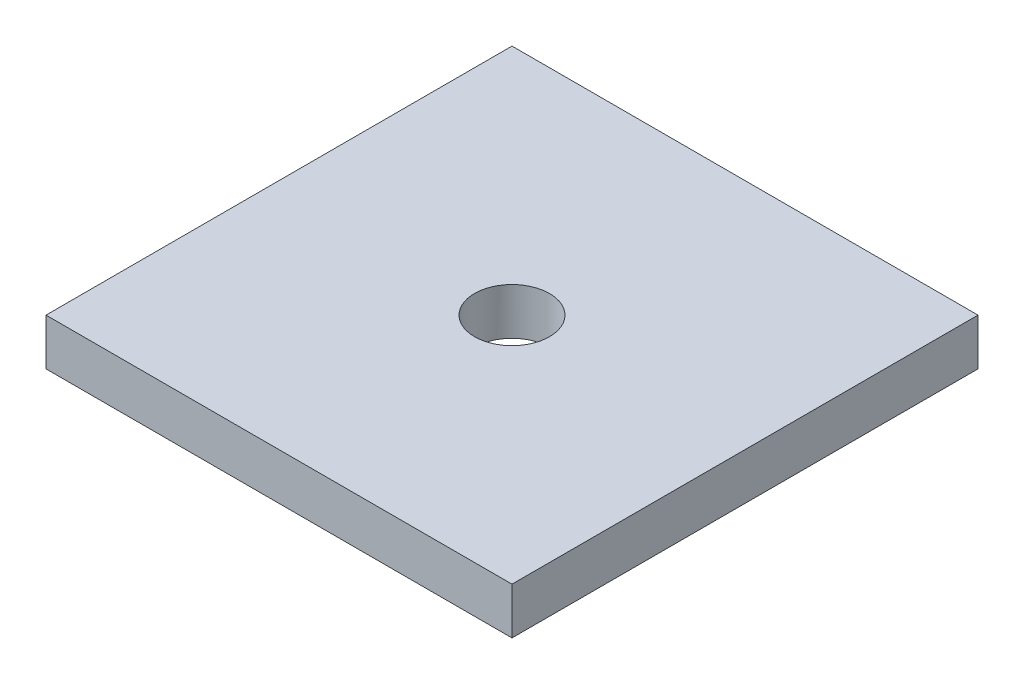
ISO-10303-21;
HEADER;
FILE_DESCRIPTION(('STEP AP214'),'2;1');
FILE_NAME('part.step','',(''),(''),'','','');
FILE_SCHEMA(('AUTOMOTIVE_DESIGN { 1 0 10303 214 1 1 1 1 }'));
ENDSEC;
DATA;
#1=APPLICATION_CONTEXT('core data for automotive mechanical design processes');
#2=APPLICATION_PROTOCOL_DEFINITION('international standard','automotive_design',2000,#1);
#3=PRODUCT_CONTEXT('',#1,'mechanical');
#4=PRODUCT('Part','Part','',(#3));
#5=PRODUCT_RELATED_PRODUCT_CATEGORY('part','',(#4));
#6=PRODUCT_DEFINITION_FORMATION('','',#4);
#7=PRODUCT_DEFINITION_CONTEXT('part definition',#1,'design');
#8=PRODUCT_DEFINITION('design','',#6,#7);
#9=PRODUCT_DEFINITION_SHAPE('','',#8);
#10=(LENGTH_UNIT() NAMED_UNIT(*) SI_UNIT(.MILLI.,.METRE.));
#11=(NAMED_UNIT(*) PLANE_ANGLE_UNIT() SI_UNIT($,.RADIAN.));
#12=(NAMED_UNIT(*) SI_UNIT($,.STERADIAN.) SOLID_ANGLE_UNIT());
#13=UNCERTAINTY_MEASURE_WITH_UNIT(LENGTH_MEASURE(1.E-05),#10,'distance_accuracy_value','');
#14=(GEOMETRIC_REPRESENTATION_CONTEXT(3) GLOBAL_UNCERTAINTY_ASSIGNED_CONTEXT((#13)) GLOBAL_UNIT_ASSIGNED_CONTEXT((#10,
#11,#12)) REPRESENTATION_CONTEXT('',''));
#15=CARTESIAN_POINT('',(0.,0.,0.));
#16=DIRECTION('',(0.,0.,1.));
#17=DIRECTION('',(1.,0.,0.));
#18=AXIS2_PLACEMENT_3D('',#15,#16,#17);
#19=CARTESIAN_POINT('',(0.,3.175,0.));
#20=DIRECTION('',(1.,0.,0.));
#21=DIRECTION('',(0.,0.,-1.));
#22=AXIS2_PLACEMENT_3D('',#19,#20,#21);
#23=PLANE('',#22);
#24=DIRECTION('',(0.,0.,1.));
#25=VECTOR('',#24,1.);
#26=CARTESIAN_POINT('',(0.,0.,0.));
#27=LINE('',#26,#25);
#28=CARTESIAN_POINT('',(0.,0.,-31.75));
#29=VERTEX_POINT('',#28);
#30=CARTESIAN_POINT('',(0.,0.,0.));
#31=VERTEX_POINT('',#30);
#32=EDGE_CURVE('E114',#29,#31,#27,.T.);
#33=ORIENTED_EDGE('',*,*,#32,.T.);
#34=DIRECTION('',(0.,-1.,0.));
#35=VECTOR('',#34,1.);
#36=CARTESIAN_POINT('',(0.,3.175,0.));
#37=LINE('',#36,#35);
#38=CARTESIAN_POINT('',(0.,3.175,0.));
#39=VERTEX_POINT('',#38);
#40=EDGE_CURVE('E11',#39,#31,#37,.T.);
#41=ORIENTED_EDGE('',*,*,#40,.F.);
#42=DIRECTION('',(0.,0.,1.));
#43=VECTOR('',#42,1.);
#44=CARTESIAN_POINT('',(0.,3.175,0.));
#45=LINE('',#44,#43);
#46=CARTESIAN_POINT('',(0.,3.175,-31.75));
#47=VERTEX_POINT('',#46);
#48=EDGE_CURVE('E101',#47,#39,#45,.T.);
#49=ORIENTED_EDGE('',*,*,#48,.F.);
#50=DIRECTION('',(0.,-1.,0.));
#51=VECTOR('',#50,1.);
#52=CARTESIAN_POINT('',(0.,3.175,-31.75));
#53=LINE('',#52,#51);
#54=EDGE_CURVE('E110',#47,#29,#53,.T.);
#55=ORIENTED_EDGE('',*,*,#54,.T.);
#56=EDGE_LOOP('',(#33,#41,#49,#55));
#57=FACE_BOUND('',#56,.T.);
#58=ADVANCED_FACE('F49',(#57),#23,.F.);
#59=CARTESIAN_POINT('',(0.,3.175,0.));
#60=DIRECTION('',(0.,0.,-1.));
#61=DIRECTION('',(-1.,0.,0.));
#62=AXIS2_PLACEMENT_3D('',#59,#60,#61);
#63=PLANE('',#62);
#64=DIRECTION('',(1.,0.,0.));
#65=VECTOR('',#64,1.);
#66=CARTESIAN_POINT('',(0.,0.,0.));
#67=LINE('',#66,#65);
#68=CARTESIAN_POINT('',(31.75,0.,0.));
#69=VERTEX_POINT('',#68);
#70=EDGE_CURVE('E105',#31,#69,#67,.T.);
#71=ORIENTED_EDGE('',*,*,#70,.T.);
#72=DIRECTION('',(0.,-1.,0.));
#73=VECTOR('',#72,1.);
#74=CARTESIAN_POINT('',(31.75,3.175,0.));
#75=LINE('',#74,#73);
#76=CARTESIAN_POINT('',(31.75,3.175,0.));
#77=VERTEX_POINT('',#76);
#78=EDGE_CURVE('E58',#77,#69,#75,.T.);
#79=ORIENTED_EDGE('',*,*,#78,.F.);
#80=DIRECTION('',(1.,0.,0.));
#81=VECTOR('',#80,1.);
#82=CARTESIAN_POINT('',(0.,3.175,0.));
#83=LINE('',#82,#81);
#84=EDGE_CURVE('E96',#39,#77,#83,.T.);
#85=ORIENTED_EDGE('',*,*,#84,.F.);
#86=ORIENTED_EDGE('',*,*,#40,.T.);
#87=EDGE_LOOP('',(#71,#79,#85,#86));
#88=FACE_BOUND('',#87,.T.);
#89=ADVANCED_FACE('F104',(#88),#63,.F.);
#90=CARTESIAN_POINT('',(31.75,3.175,0.));
#91=DIRECTION('',(-1.,0.,0.));
#92=DIRECTION('',(0.,0.,1.));
#93=AXIS2_PLACEMENT_3D('',#90,#91,#92);
#94=PLANE('',#93);
#95=DIRECTION('',(0.,0.,-1.));
#96=VECTOR('',#95,1.);
#97=CARTESIAN_POINT('',(31.75,0.,0.));
#98=LINE('',#97,#96);
#99=CARTESIAN_POINT('',(31.75,0.,-31.75));
#100=VERTEX_POINT('',#99);
#101=EDGE_CURVE('E83',#69,#100,#98,.T.);
#102=ORIENTED_EDGE('',*,*,#101,.T.);
#103=DIRECTION('',(0.,-1.,0.));
#104=VECTOR('',#103,1.);
#105=CARTESIAN_POINT('',(31.75,3.175,-31.75));
#106=LINE('',#105,#104);
#107=CARTESIAN_POINT('',(31.75,3.175,-31.75));
#108=VERTEX_POINT('',#107);
#109=EDGE_CURVE('E106',#108,#100,#106,.T.);
#110=ORIENTED_EDGE('',*,*,#109,.F.);
#111=DIRECTION('',(0.,0.,-1.));
#112=VECTOR('',#111,1.);
#113=CARTESIAN_POINT('',(31.75,3.175,0.));
#114=LINE('',#113,#112);
#115=EDGE_CURVE('E99',#77,#108,#114,.T.);
#116=ORIENTED_EDGE('',*,*,#115,.F.);
#117=ORIENTED_EDGE('',*,*,#78,.T.);
#118=EDGE_LOOP('',(#102,#110,#116,#117));
#119=FACE_BOUND('',#118,.T.);
#120=ADVANCED_FACE('F108',(#119),#94,.F.);
#121=CARTESIAN_POINT('',(0.,3.175,-31.75));
#122=DIRECTION('',(0.,0.,1.));
#123=DIRECTION('',(1.,0.,0.));
#124=AXIS2_PLACEMENT_3D('',#121,#122,#123);
#125=PLANE('',#124);
#126=DIRECTION('',(-1.,0.,0.));
#127=VECTOR('',#126,1.);
#128=CARTESIAN_POINT('',(0.,0.,-31.75));
#129=LINE('',#128,#127);
#130=EDGE_CURVE('E89',#100,#29,#129,.T.);
#131=ORIENTED_EDGE('',*,*,#130,.T.);
#132=ORIENTED_EDGE('',*,*,#54,.F.);
#133=DIRECTION('',(-1.,0.,0.));
#134=VECTOR('',#133,1.);
#135=CARTESIAN_POINT('',(0.,3.175,-31.75));
#136=LINE('',#135,#134);
#137=EDGE_CURVE('E66',#108,#47,#136,.T.);
#138=ORIENTED_EDGE('',*,*,#137,.F.);
#139=ORIENTED_EDGE('',*,*,#109,.T.);
#140=EDGE_LOOP('',(#131,#132,#138,#139));
#141=FACE_BOUND('',#140,.T.);
#142=ADVANCED_FACE('F121',(#141),#125,.F.);
#143=CARTESIAN_POINT('',(0.,3.175,0.));
#144=DIRECTION('',(0.,-1.,0.));
#145=DIRECTION('',(0.,0.,-1.));
#146=AXIS2_PLACEMENT_3D('',#143,#144,#145);
#147=PLANE('',#146);
#148=CARTESIAN_POINT('',(15.875,3.175,-15.875));
#149=DIRECTION('',(0.,1.,0.));
#150=DIRECTION('',(0.,0.,1.));
#151=AXIS2_PLACEMENT_3D('',#148,#149,#150);
#152=CIRCLE('',#151,2.55269999999999);
#153=CARTESIAN_POINT('',(15.875,3.175,-13.3223));
#154=VERTEX_POINT('',#153);
#155=EDGE_CURVE('E127',#154,#154,#152,.T.);
#156=ORIENTED_EDGE('',*,*,#155,.F.);
#157=EDGE_LOOP('',(#156));
#158=FACE_BOUND('',#157,.T.);
#159=ORIENTED_EDGE('',*,*,#48,.T.);
#160=ORIENTED_EDGE('',*,*,#84,.T.);
#161=ORIENTED_EDGE('',*,*,#115,.T.);
#162=ORIENTED_EDGE('',*,*,#137,.T.);
#163=EDGE_LOOP('',(#159,#160,#161,#162));
#164=FACE_BOUND('',#163,.T.);
#165=ADVANCED_FACE('F97',(#158,#164),#147,.F.);
#166=CARTESIAN_POINT('',(0.,0.,0.));
#167=DIRECTION('',(0.,-1.,0.));
#168=DIRECTION('',(0.,0.,-1.));
#169=AXIS2_PLACEMENT_3D('',#166,#167,#168);
#170=PLANE('',#169);
#171=CARTESIAN_POINT('',(15.875,0.,-15.875));
#172=DIRECTION('',(0.,-1.,0.));
#173=DIRECTION('',(0.,0.,-1.));
#174=AXIS2_PLACEMENT_3D('',#171,#172,#173);
#175=CIRCLE('',#174,2.55269999999999);
#176=CARTESIAN_POINT('',(15.875,0.,-18.4277));
#177=VERTEX_POINT('',#176);
#178=EDGE_CURVE('E52',#177,#177,#175,.T.);
#179=ORIENTED_EDGE('',*,*,#178,.F.);
#180=EDGE_LOOP('',(#179));
#181=FACE_BOUND('',#180,.T.);
#182=ORIENTED_EDGE('',*,*,#32,.F.);
#183=ORIENTED_EDGE('',*,*,#130,.F.);
#184=ORIENTED_EDGE('',*,*,#101,.F.);
#185=ORIENTED_EDGE('',*,*,#70,.F.);
#186=EDGE_LOOP('',(#182,#183,#184,#185));
#187=FACE_BOUND('',#186,.T.);
#188=ADVANCED_FACE('F124',(#181,#187),#170,.T.);
#189=CARTESIAN_POINT('',(15.875,3.175,-15.875));
#190=DIRECTION('',(0.,1.,0.));
#191=DIRECTION('',(0.,0.,1.));
#192=AXIS2_PLACEMENT_3D('',#189,#190,#191);
#193=CYLINDRICAL_SURFACE('',#192,2.55269999999999);
#194=ORIENTED_EDGE('',*,*,#178,.T.);
#195=EDGE_LOOP('',(#194));
#196=FACE_BOUND('',#195,.T.);
#197=ORIENTED_EDGE('',*,*,#155,.T.);
#198=EDGE_LOOP('',(#197));
#199=FACE_BOUND('',#198,.T.);
#200=ADVANCED_FACE('F134',(#196,#199),#193,.F.);
#201=CLOSED_SHELL('',(#58,#89,#120,#142,#165,#188,#200));
#202=MANIFOLD_SOLID_BREP('B2',#201);
#203=ADVANCED_BREP_SHAPE_REPRESENTATION('',(#18,#202),#14);
#204=SHAPE_DEFINITION_REPRESENTATION(#9,#203);
ENDSEC;
END-ISO-10303-21;
